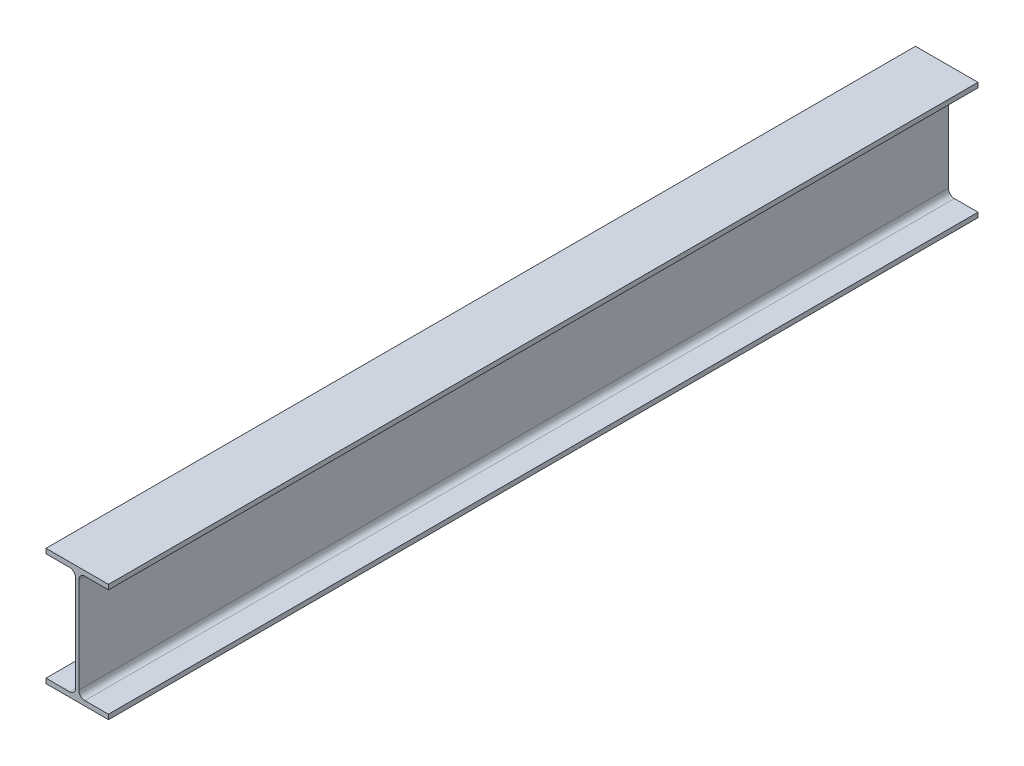
ISO-10303-21;
HEADER;
FILE_DESCRIPTION(('STEP AP214'),'2;1');
FILE_NAME('part.step','',(''),(''),'','','');
FILE_SCHEMA(('AUTOMOTIVE_DESIGN { 1 0 10303 214 1 1 1 1 }'));
ENDSEC;
DATA;
#1=APPLICATION_CONTEXT('core data for automotive mechanical design processes');
#2=APPLICATION_PROTOCOL_DEFINITION('international standard','automotive_design',2000,#1);
#3=PRODUCT_CONTEXT('',#1,'mechanical');
#4=PRODUCT('Part','Part','',(#3));
#5=PRODUCT_RELATED_PRODUCT_CATEGORY('part','',(#4));
#6=PRODUCT_DEFINITION_FORMATION('','',#4);
#7=PRODUCT_DEFINITION_CONTEXT('part definition',#1,'design');
#8=PRODUCT_DEFINITION('design','',#6,#7);
#9=PRODUCT_DEFINITION_SHAPE('','',#8);
#10=(LENGTH_UNIT() NAMED_UNIT(*) SI_UNIT(.MILLI.,.METRE.));
#11=(NAMED_UNIT(*) PLANE_ANGLE_UNIT() SI_UNIT($,.RADIAN.));
#12=(NAMED_UNIT(*) SI_UNIT($,.STERADIAN.) SOLID_ANGLE_UNIT());
#13=UNCERTAINTY_MEASURE_WITH_UNIT(LENGTH_MEASURE(1.E-05),#10,'distance_accuracy_value','');
#14=(GEOMETRIC_REPRESENTATION_CONTEXT(3) GLOBAL_UNCERTAINTY_ASSIGNED_CONTEXT((#13)) GLOBAL_UNIT_ASSIGNED_CONTEXT((#10,
#11,#12)) REPRESENTATION_CONTEXT('',''));
#15=CARTESIAN_POINT('',(0.,0.,0.));
#16=DIRECTION('',(0.,0.,1.));
#17=DIRECTION('',(1.,0.,0.));
#18=AXIS2_PLACEMENT_3D('',#15,#16,#17);
#19=CARTESIAN_POINT('',(-36.5,8.49645084468045,1016.));
#20=DIRECTION('',(1.,0.,0.));
#21=DIRECTION('',(0.,0.,-1.));
#22=AXIS2_PLACEMENT_3D('',#19,#20,#21);
#23=PLANE('',#22);
#24=DIRECTION('',(0.,-1.,0.));
#25=VECTOR('',#24,1.);
#26=CARTESIAN_POINT('',(-36.5,8.49645084468045,0.));
#27=LINE('',#26,#25);
#28=CARTESIAN_POINT('',(-36.5,14.0964508446805,0.));
#29=VERTEX_POINT('',#28);
#30=CARTESIAN_POINT('',(-36.5,8.49645084468045,0.));
#31=VERTEX_POINT('',#30);
#32=EDGE_CURVE('E190',#29,#31,#27,.T.);
#33=ORIENTED_EDGE('',*,*,#32,.T.);
#34=DIRECTION('',(0.,0.,-1.));
#35=VECTOR('',#34,1.);
#36=CARTESIAN_POINT('',(-36.5,8.49645084468045,1016.));
#37=LINE('',#36,#35);
#38=CARTESIAN_POINT('',(-36.5,8.49645084468045,1016.));
#39=VERTEX_POINT('',#38);
#40=EDGE_CURVE('E11',#39,#31,#37,.T.);
#41=ORIENTED_EDGE('',*,*,#40,.F.);
#42=DIRECTION('',(0.,-1.,0.));
#43=VECTOR('',#42,1.);
#44=CARTESIAN_POINT('',(-36.5,8.49645084468045,1016.));
#45=LINE('',#44,#43);
#46=CARTESIAN_POINT('',(-36.5,14.0964508446805,1016.));
#47=VERTEX_POINT('',#46);
#48=EDGE_CURVE('E236',#47,#39,#45,.T.);
#49=ORIENTED_EDGE('',*,*,#48,.F.);
#50=DIRECTION('',(0.,0.,-1.));
#51=VECTOR('',#50,1.);
#52=CARTESIAN_POINT('',(-36.5,14.0964508446805,1016.));
#53=LINE('',#52,#51);
#54=EDGE_CURVE('E186',#47,#29,#53,.T.);
#55=ORIENTED_EDGE('',*,*,#54,.T.);
#56=EDGE_LOOP('',(#33,#41,#49,#55));
#57=FACE_BOUND('',#56,.T.);
#58=ADVANCED_FACE('F41',(#57),#23,.F.);
#59=CARTESIAN_POINT('',(-8.9,8.49645084468046,1016.));
#60=DIRECTION('',(0.,1.,0.));
#61=DIRECTION('',(-1.,0.,0.));
#62=AXIS2_PLACEMENT_3D('',#59,#60,#61);
#63=PLANE('',#62);
#64=DIRECTION('',(1.,0.,0.));
#65=VECTOR('',#64,1.);
#66=CARTESIAN_POINT('',(-8.9,8.49645084468046,0.));
#67=LINE('',#66,#65);
#68=CARTESIAN_POINT('',(-8.9,8.49645084468046,0.));
#69=VERTEX_POINT('',#68);
#70=EDGE_CURVE('E194',#31,#69,#67,.T.);
#71=ORIENTED_EDGE('',*,*,#70,.T.);
#72=DIRECTION('',(0.,0.,-1.));
#73=VECTOR('',#72,1.);
#74=CARTESIAN_POINT('',(-8.9,8.49645084468046,1016.));
#75=LINE('',#74,#73);
#76=CARTESIAN_POINT('',(-8.9,8.49645084468046,1016.));
#77=VERTEX_POINT('',#76);
#78=EDGE_CURVE('E50',#77,#69,#75,.T.);
#79=ORIENTED_EDGE('',*,*,#78,.F.);
#80=DIRECTION('',(1.,0.,0.));
#81=VECTOR('',#80,1.);
#82=CARTESIAN_POINT('',(-8.9,8.49645084468046,1016.));
#83=LINE('',#82,#81);
#84=EDGE_CURVE('E125',#39,#77,#83,.T.);
#85=ORIENTED_EDGE('',*,*,#84,.F.);
#86=ORIENTED_EDGE('',*,*,#40,.T.);
#87=EDGE_LOOP('',(#71,#79,#85,#86));
#88=FACE_BOUND('',#87,.T.);
#89=ADVANCED_FACE('F358',(#88),#63,.F.);
#90=CARTESIAN_POINT('',(-8.9,1.49645084468046,1016.));
#91=DIRECTION('',(0.,0.,-1.));
#92=DIRECTION('',(-1.,0.,0.));
#93=AXIS2_PLACEMENT_3D('',#90,#91,#92);
#94=CYLINDRICAL_SURFACE('',#93,7.);
#95=CARTESIAN_POINT('',(-8.9,1.49645084468046,0.));
#96=DIRECTION('',(0.,0.,-1.));
#97=DIRECTION('',(-1.,0.,0.));
#98=AXIS2_PLACEMENT_3D('',#95,#96,#97);
#99=CIRCLE('',#98,7.);
#100=CARTESIAN_POINT('',(-1.9,1.49645084468046,0.));
#101=VERTEX_POINT('',#100);
#102=EDGE_CURVE('E197',#69,#101,#99,.T.);
#103=ORIENTED_EDGE('',*,*,#102,.T.);
#104=DIRECTION('',(0.,0.,-1.));
#105=VECTOR('',#104,1.);
#106=CARTESIAN_POINT('',(-1.9,1.49645084468046,1016.));
#107=LINE('',#106,#105);
#108=CARTESIAN_POINT('',(-1.9,1.49645084468046,1016.));
#109=VERTEX_POINT('',#108);
#110=EDGE_CURVE('E279',#109,#101,#107,.T.);
#111=ORIENTED_EDGE('',*,*,#110,.F.);
#112=CARTESIAN_POINT('',(-8.9,1.49645084468046,1016.));
#113=DIRECTION('',(0.,0.,-1.));
#114=DIRECTION('',(-1.,0.,0.));
#115=AXIS2_PLACEMENT_3D('',#112,#113,#114);
#116=CIRCLE('',#115,7.);
#117=EDGE_CURVE('E289',#77,#109,#116,.T.);
#118=ORIENTED_EDGE('',*,*,#117,.F.);
#119=ORIENTED_EDGE('',*,*,#78,.T.);
#120=EDGE_LOOP('',(#103,#111,#118,#119));
#121=FACE_BOUND('',#120,.T.);
#122=ADVANCED_FACE('F287',(#121),#94,.F.);
#123=CARTESIAN_POINT('',(-1.9,-110.30354915532,1016.));
#124=DIRECTION('',(1.,0.,0.));
#125=DIRECTION('',(0.,0.,-1.));
#126=AXIS2_PLACEMENT_3D('',#123,#124,#125);
#127=PLANE('',#126);
#128=DIRECTION('',(0.,-1.,0.));
#129=VECTOR('',#128,1.);
#130=CARTESIAN_POINT('',(-1.9,-110.30354915532,0.));
#131=LINE('',#130,#129);
#132=CARTESIAN_POINT('',(-1.9,-110.30354915532,0.));
#133=VERTEX_POINT('',#132);
#134=EDGE_CURVE('E200',#101,#133,#131,.T.);
#135=ORIENTED_EDGE('',*,*,#134,.T.);
#136=DIRECTION('',(0.,0.,-1.));
#137=VECTOR('',#136,1.);
#138=CARTESIAN_POINT('',(-1.9,-110.30354915532,1016.));
#139=LINE('',#138,#137);
#140=CARTESIAN_POINT('',(-1.9,-110.30354915532,1016.));
#141=VERTEX_POINT('',#140);
#142=EDGE_CURVE('E275',#141,#133,#139,.T.);
#143=ORIENTED_EDGE('',*,*,#142,.F.);
#144=DIRECTION('',(0.,-1.,0.));
#145=VECTOR('',#144,1.);
#146=CARTESIAN_POINT('',(-1.9,-110.30354915532,1016.));
#147=LINE('',#146,#145);
#148=EDGE_CURVE('E308',#109,#141,#147,.T.);
#149=ORIENTED_EDGE('',*,*,#148,.F.);
#150=ORIENTED_EDGE('',*,*,#110,.T.);
#151=EDGE_LOOP('',(#135,#143,#149,#150));
#152=FACE_BOUND('',#151,.T.);
#153=ADVANCED_FACE('F298',(#152),#127,.F.);
#154=CARTESIAN_POINT('',(-8.9,-110.30354915532,1016.));
#155=DIRECTION('',(0.,0.,-1.));
#156=DIRECTION('',(-1.,0.,0.));
#157=AXIS2_PLACEMENT_3D('',#154,#155,#156);
#158=CYLINDRICAL_SURFACE('',#157,7.);
#159=CARTESIAN_POINT('',(-8.9,-110.30354915532,0.));
#160=DIRECTION('',(0.,0.,-1.));
#161=DIRECTION('',(-1.,0.,0.));
#162=AXIS2_PLACEMENT_3D('',#159,#160,#161);
#163=CIRCLE('',#162,7.);
#164=CARTESIAN_POINT('',(-8.9,-117.30354915532,0.));
#165=VERTEX_POINT('',#164);
#166=EDGE_CURVE('E203',#133,#165,#163,.T.);
#167=ORIENTED_EDGE('',*,*,#166,.T.);
#168=DIRECTION('',(0.,0.,-1.));
#169=VECTOR('',#168,1.);
#170=CARTESIAN_POINT('',(-8.9,-117.30354915532,1016.));
#171=LINE('',#170,#169);
#172=CARTESIAN_POINT('',(-8.9,-117.30354915532,1016.));
#173=VERTEX_POINT('',#172);
#174=EDGE_CURVE('E271',#173,#165,#171,.T.);
#175=ORIENTED_EDGE('',*,*,#174,.F.);
#176=CARTESIAN_POINT('',(-8.9,-110.30354915532,1016.));
#177=DIRECTION('',(0.,0.,-1.));
#178=DIRECTION('',(-1.,0.,0.));
#179=AXIS2_PLACEMENT_3D('',#176,#177,#178);
#180=CIRCLE('',#179,7.);
#181=EDGE_CURVE('E304',#141,#173,#180,.T.);
#182=ORIENTED_EDGE('',*,*,#181,.F.);
#183=ORIENTED_EDGE('',*,*,#142,.T.);
#184=EDGE_LOOP('',(#167,#175,#182,#183));
#185=FACE_BOUND('',#184,.T.);
#186=ADVANCED_FACE('F302',(#185),#158,.F.);
#187=CARTESIAN_POINT('',(-36.5,-117.30354915532,1016.));
#188=DIRECTION('',(0.,-1.,0.));
#189=DIRECTION('',(0.,0.,-1.));
#190=AXIS2_PLACEMENT_3D('',#187,#188,#189);
#191=PLANE('',#190);
#192=DIRECTION('',(-1.,0.,0.));
#193=VECTOR('',#192,1.);
#194=CARTESIAN_POINT('',(-36.5,-117.30354915532,0.));
#195=LINE('',#194,#193);
#196=CARTESIAN_POINT('',(-36.5,-117.30354915532,0.));
#197=VERTEX_POINT('',#196);
#198=EDGE_CURVE('E206',#165,#197,#195,.T.);
#199=ORIENTED_EDGE('',*,*,#198,.T.);
#200=DIRECTION('',(0.,0.,-1.));
#201=VECTOR('',#200,1.);
#202=CARTESIAN_POINT('',(-36.5,-117.30354915532,1016.));
#203=LINE('',#202,#201);
#204=CARTESIAN_POINT('',(-36.5,-117.30354915532,1016.));
#205=VERTEX_POINT('',#204);
#206=EDGE_CURVE('E267',#205,#197,#203,.T.);
#207=ORIENTED_EDGE('',*,*,#206,.F.);
#208=DIRECTION('',(-1.,0.,0.));
#209=VECTOR('',#208,1.);
#210=CARTESIAN_POINT('',(-36.5,-117.30354915532,1016.));
#211=LINE('',#210,#209);
#212=EDGE_CURVE('E307',#173,#205,#211,.T.);
#213=ORIENTED_EDGE('',*,*,#212,.F.);
#214=ORIENTED_EDGE('',*,*,#174,.T.);
#215=EDGE_LOOP('',(#199,#207,#213,#214));
#216=FACE_BOUND('',#215,.T.);
#217=ADVANCED_FACE('F371',(#216),#191,.F.);
#218=CARTESIAN_POINT('',(-36.5,-122.90354915532,1016.));
#219=DIRECTION('',(1.,0.,0.));
#220=DIRECTION('',(0.,1.,0.));
#221=AXIS2_PLACEMENT_3D('',#218,#219,#220);
#222=PLANE('',#221);
#223=DIRECTION('',(0.,-1.,0.));
#224=VECTOR('',#223,1.);
#225=CARTESIAN_POINT('',(-36.5,-122.90354915532,0.));
#226=LINE('',#225,#224);
#227=CARTESIAN_POINT('',(-36.5,-122.90354915532,0.));
#228=VERTEX_POINT('',#227);
#229=EDGE_CURVE('E209',#197,#228,#226,.T.);
#230=ORIENTED_EDGE('',*,*,#229,.T.);
#231=DIRECTION('',(0.,0.,-1.));
#232=VECTOR('',#231,1.);
#233=CARTESIAN_POINT('',(-36.5,-122.90354915532,1016.));
#234=LINE('',#233,#232);
#235=CARTESIAN_POINT('',(-36.5,-122.90354915532,1016.));
#236=VERTEX_POINT('',#235);
#237=EDGE_CURVE('E263',#236,#228,#234,.T.);
#238=ORIENTED_EDGE('',*,*,#237,.F.);
#239=DIRECTION('',(0.,-1.,0.));
#240=VECTOR('',#239,1.);
#241=CARTESIAN_POINT('',(-36.5,-122.90354915532,1016.));
#242=LINE('',#241,#240);
#243=EDGE_CURVE('E312',#205,#236,#242,.T.);
#244=ORIENTED_EDGE('',*,*,#243,.F.);
#245=ORIENTED_EDGE('',*,*,#206,.T.);
#246=EDGE_LOOP('',(#230,#238,#244,#245));
#247=FACE_BOUND('',#246,.T.);
#248=ADVANCED_FACE('F374',(#247),#222,.F.);
#249=CARTESIAN_POINT('',(36.5,-122.90354915532,1016.));
#250=DIRECTION('',(0.,1.,0.));
#251=DIRECTION('',(-1.,0.,0.));
#252=AXIS2_PLACEMENT_3D('',#249,#250,#251);
#253=PLANE('',#252);
#254=DIRECTION('',(1.,0.,0.));
#255=VECTOR('',#254,1.);
#256=CARTESIAN_POINT('',(36.5,-122.90354915532,0.));
#257=LINE('',#256,#255);
#258=CARTESIAN_POINT('',(36.5,-122.90354915532,0.));
#259=VERTEX_POINT('',#258);
#260=EDGE_CURVE('E212',#228,#259,#257,.T.);
#261=ORIENTED_EDGE('',*,*,#260,.T.);
#262=DIRECTION('',(0.,0.,-1.));
#263=VECTOR('',#262,1.);
#264=CARTESIAN_POINT('',(36.5,-122.90354915532,1016.));
#265=LINE('',#264,#263);
#266=CARTESIAN_POINT('',(36.5,-122.90354915532,1016.));
#267=VERTEX_POINT('',#266);
#268=EDGE_CURVE('E259',#267,#259,#265,.T.);
#269=ORIENTED_EDGE('',*,*,#268,.F.);
#270=DIRECTION('',(1.,0.,0.));
#271=VECTOR('',#270,1.);
#272=CARTESIAN_POINT('',(36.5,-122.90354915532,1016.));
#273=LINE('',#272,#271);
#274=EDGE_CURVE('E319',#236,#267,#273,.T.);
#275=ORIENTED_EDGE('',*,*,#274,.F.);
#276=ORIENTED_EDGE('',*,*,#237,.T.);
#277=EDGE_LOOP('',(#261,#269,#275,#276));
#278=FACE_BOUND('',#277,.T.);
#279=ADVANCED_FACE('F378',(#278),#253,.F.);
#280=CARTESIAN_POINT('',(36.5,-117.30354915532,1016.));
#281=DIRECTION('',(-1.,0.,0.));
#282=DIRECTION('',(0.,-1.,0.));
#283=AXIS2_PLACEMENT_3D('',#280,#281,#282);
#284=PLANE('',#283);
#285=DIRECTION('',(0.,1.,0.));
#286=VECTOR('',#285,1.);
#287=CARTESIAN_POINT('',(36.5,-117.30354915532,0.));
#288=LINE('',#287,#286);
#289=CARTESIAN_POINT('',(36.5,-117.30354915532,0.));
#290=VERTEX_POINT('',#289);
#291=EDGE_CURVE('E215',#259,#290,#288,.T.);
#292=ORIENTED_EDGE('',*,*,#291,.T.);
#293=DIRECTION('',(0.,0.,-1.));
#294=VECTOR('',#293,1.);
#295=CARTESIAN_POINT('',(36.5,-117.30354915532,1016.));
#296=LINE('',#295,#294);
#297=CARTESIAN_POINT('',(36.5,-117.30354915532,1016.));
#298=VERTEX_POINT('',#297);
#299=EDGE_CURVE('E255',#298,#290,#296,.T.);
#300=ORIENTED_EDGE('',*,*,#299,.F.);
#301=DIRECTION('',(0.,1.,0.));
#302=VECTOR('',#301,1.);
#303=CARTESIAN_POINT('',(36.5,-117.30354915532,1016.));
#304=LINE('',#303,#302);
#305=EDGE_CURVE('E322',#267,#298,#304,.T.);
#306=ORIENTED_EDGE('',*,*,#305,.F.);
#307=ORIENTED_EDGE('',*,*,#268,.T.);
#308=EDGE_LOOP('',(#292,#300,#306,#307));
#309=FACE_BOUND('',#308,.T.);
#310=ADVANCED_FACE('F382',(#309),#284,.F.);
#311=CARTESIAN_POINT('',(8.90000000000001,-117.30354915532,1016.));
#312=DIRECTION('',(0.,-1.,0.));
#313=DIRECTION('',(0.,0.,-1.));
#314=AXIS2_PLACEMENT_3D('',#311,#312,#313);
#315=PLANE('',#314);
#316=DIRECTION('',(-1.,0.,0.));
#317=VECTOR('',#316,1.);
#318=CARTESIAN_POINT('',(8.90000000000001,-117.30354915532,0.));
#319=LINE('',#318,#317);
#320=CARTESIAN_POINT('',(8.90000000000002,-117.30354915532,0.));
#321=VERTEX_POINT('',#320);
#322=EDGE_CURVE('E218',#290,#321,#319,.T.);
#323=ORIENTED_EDGE('',*,*,#322,.T.);
#324=DIRECTION('',(0.,0.,-1.));
#325=VECTOR('',#324,1.);
#326=CARTESIAN_POINT('',(8.90000000000002,-117.30354915532,1016.));
#327=LINE('',#326,#325);
#328=CARTESIAN_POINT('',(8.90000000000002,-117.30354915532,1016.));
#329=VERTEX_POINT('',#328);
#330=EDGE_CURVE('E251',#329,#321,#327,.T.);
#331=ORIENTED_EDGE('',*,*,#330,.F.);
#332=DIRECTION('',(-1.,0.,0.));
#333=VECTOR('',#332,1.);
#334=CARTESIAN_POINT('',(8.90000000000001,-117.30354915532,1016.));
#335=LINE('',#334,#333);
#336=EDGE_CURVE('E325',#298,#329,#335,.T.);
#337=ORIENTED_EDGE('',*,*,#336,.F.);
#338=ORIENTED_EDGE('',*,*,#299,.T.);
#339=EDGE_LOOP('',(#323,#331,#337,#338));
#340=FACE_BOUND('',#339,.T.);
#341=ADVANCED_FACE('F386',(#340),#315,.F.);
#342=CARTESIAN_POINT('',(8.90000000000001,-110.30354915532,1016.));
#343=DIRECTION('',(0.,0.,-1.));
#344=DIRECTION('',(-1.,0.,0.));
#345=AXIS2_PLACEMENT_3D('',#342,#343,#344);
#346=CYLINDRICAL_SURFACE('',#345,7.);
#347=CARTESIAN_POINT('',(8.90000000000001,-110.30354915532,0.));
#348=DIRECTION('',(0.,0.,-1.));
#349=DIRECTION('',(-1.,0.,0.));
#350=AXIS2_PLACEMENT_3D('',#347,#348,#349);
#351=CIRCLE('',#350,7.);
#352=CARTESIAN_POINT('',(1.90000000000001,-110.30354915532,0.));
#353=VERTEX_POINT('',#352);
#354=EDGE_CURVE('E221',#321,#353,#351,.T.);
#355=ORIENTED_EDGE('',*,*,#354,.T.);
#356=DIRECTION('',(0.,0.,-1.));
#357=VECTOR('',#356,1.);
#358=CARTESIAN_POINT('',(1.90000000000001,-110.30354915532,1016.));
#359=LINE('',#358,#357);
#360=CARTESIAN_POINT('',(1.90000000000001,-110.30354915532,1016.));
#361=VERTEX_POINT('',#360);
#362=EDGE_CURVE('E247',#361,#353,#359,.T.);
#363=ORIENTED_EDGE('',*,*,#362,.F.);
#364=CARTESIAN_POINT('',(8.90000000000001,-110.30354915532,1016.));
#365=DIRECTION('',(0.,0.,-1.));
#366=DIRECTION('',(-1.,0.,0.));
#367=AXIS2_PLACEMENT_3D('',#364,#365,#366);
#368=CIRCLE('',#367,7.);
#369=EDGE_CURVE('E328',#329,#361,#368,.T.);
#370=ORIENTED_EDGE('',*,*,#369,.F.);
#371=ORIENTED_EDGE('',*,*,#330,.T.);
#372=EDGE_LOOP('',(#355,#363,#370,#371));
#373=FACE_BOUND('',#372,.T.);
#374=ADVANCED_FACE('F390',(#373),#346,.F.);
#375=CARTESIAN_POINT('',(1.9,1.49645084468046,1016.));
#376=DIRECTION('',(-1.,0.,0.));
#377=DIRECTION('',(0.,-1.,0.));
#378=AXIS2_PLACEMENT_3D('',#375,#376,#377);
#379=PLANE('',#378);
#380=DIRECTION('',(0.,1.,0.));
#381=VECTOR('',#380,1.);
#382=CARTESIAN_POINT('',(1.9,1.49645084468046,0.));
#383=LINE('',#382,#381);
#384=CARTESIAN_POINT('',(1.9,1.49645084468046,0.));
#385=VERTEX_POINT('',#384);
#386=EDGE_CURVE('E224',#353,#385,#383,.T.);
#387=ORIENTED_EDGE('',*,*,#386,.T.);
#388=DIRECTION('',(0.,0.,-1.));
#389=VECTOR('',#388,1.);
#390=CARTESIAN_POINT('',(1.9,1.49645084468046,1016.));
#391=LINE('',#390,#389);
#392=CARTESIAN_POINT('',(1.9,1.49645084468046,1016.));
#393=VERTEX_POINT('',#392);
#394=EDGE_CURVE('E243',#393,#385,#391,.T.);
#395=ORIENTED_EDGE('',*,*,#394,.F.);
#396=DIRECTION('',(0.,1.,0.));
#397=VECTOR('',#396,1.);
#398=CARTESIAN_POINT('',(1.9,1.49645084468046,1016.));
#399=LINE('',#398,#397);
#400=EDGE_CURVE('E331',#361,#393,#399,.T.);
#401=ORIENTED_EDGE('',*,*,#400,.F.);
#402=ORIENTED_EDGE('',*,*,#362,.T.);
#403=EDGE_LOOP('',(#387,#395,#401,#402));
#404=FACE_BOUND('',#403,.T.);
#405=ADVANCED_FACE('F339',(#404),#379,.F.);
#406=CARTESIAN_POINT('',(8.9,1.49645084468046,1016.));
#407=DIRECTION('',(0.,0.,-1.));
#408=DIRECTION('',(-1.,0.,0.));
#409=AXIS2_PLACEMENT_3D('',#406,#407,#408);
#410=CYLINDRICAL_SURFACE('',#409,7.);
#411=CARTESIAN_POINT('',(8.9,1.49645084468046,0.));
#412=DIRECTION('',(0.,0.,-1.));
#413=DIRECTION('',(-1.,0.,0.));
#414=AXIS2_PLACEMENT_3D('',#411,#412,#413);
#415=CIRCLE('',#414,7.);
#416=CARTESIAN_POINT('',(8.9,8.49645084468046,0.));
#417=VERTEX_POINT('',#416);
#418=EDGE_CURVE('E227',#385,#417,#415,.T.);
#419=ORIENTED_EDGE('',*,*,#418,.T.);
#420=DIRECTION('',(0.,0.,-1.));
#421=VECTOR('',#420,1.);
#422=CARTESIAN_POINT('',(8.9,8.49645084468046,1016.));
#423=LINE('',#422,#421);
#424=CARTESIAN_POINT('',(8.9,8.49645084468046,1016.));
#425=VERTEX_POINT('',#424);
#426=EDGE_CURVE('E179',#425,#417,#423,.T.);
#427=ORIENTED_EDGE('',*,*,#426,.F.);
#428=CARTESIAN_POINT('',(8.9,1.49645084468046,1016.));
#429=DIRECTION('',(0.,0.,-1.));
#430=DIRECTION('',(-1.,0.,0.));
#431=AXIS2_PLACEMENT_3D('',#428,#429,#430);
#432=CIRCLE('',#431,7.);
#433=EDGE_CURVE('E168',#393,#425,#432,.T.);
#434=ORIENTED_EDGE('',*,*,#433,.F.);
#435=ORIENTED_EDGE('',*,*,#394,.T.);
#436=EDGE_LOOP('',(#419,#427,#434,#435));
#437=FACE_BOUND('',#436,.T.);
#438=ADVANCED_FACE('F343',(#437),#410,.F.);
#439=CARTESIAN_POINT('',(36.5,8.49645084468046,1016.));
#440=DIRECTION('',(0.,1.,0.));
#441=DIRECTION('',(-1.,0.,0.));
#442=AXIS2_PLACEMENT_3D('',#439,#440,#441);
#443=PLANE('',#442);
#444=DIRECTION('',(1.,0.,0.));
#445=VECTOR('',#444,1.);
#446=CARTESIAN_POINT('',(36.5,8.49645084468046,0.));
#447=LINE('',#446,#445);
#448=CARTESIAN_POINT('',(36.5,8.49645084468046,0.));
#449=VERTEX_POINT('',#448);
#450=EDGE_CURVE('E177',#417,#449,#447,.T.);
#451=ORIENTED_EDGE('',*,*,#450,.T.);
#452=DIRECTION('',(0.,0.,-1.));
#453=VECTOR('',#452,1.);
#454=CARTESIAN_POINT('',(36.5,8.49645084468046,1016.));
#455=LINE('',#454,#453);
#456=CARTESIAN_POINT('',(36.5,8.49645084468046,1016.));
#457=VERTEX_POINT('',#456);
#458=EDGE_CURVE('E174',#457,#449,#455,.T.);
#459=ORIENTED_EDGE('',*,*,#458,.F.);
#460=DIRECTION('',(1.,0.,0.));
#461=VECTOR('',#460,1.);
#462=CARTESIAN_POINT('',(36.5,8.49645084468046,1016.));
#463=LINE('',#462,#461);
#464=EDGE_CURVE('E162',#425,#457,#463,.T.);
#465=ORIENTED_EDGE('',*,*,#464,.F.);
#466=ORIENTED_EDGE('',*,*,#426,.T.);
#467=EDGE_LOOP('',(#451,#459,#465,#466));
#468=FACE_BOUND('',#467,.T.);
#469=ADVANCED_FACE('F175',(#468),#443,.F.);
#470=CARTESIAN_POINT('',(36.5,14.0964508446805,1016.));
#471=DIRECTION('',(-1.,0.,0.));
#472=DIRECTION('',(0.,0.,1.));
#473=AXIS2_PLACEMENT_3D('',#470,#471,#472);
#474=PLANE('',#473);
#475=DIRECTION('',(0.,1.,0.));
#476=VECTOR('',#475,1.);
#477=CARTESIAN_POINT('',(36.5,14.0964508446805,0.));
#478=LINE('',#477,#476);
#479=CARTESIAN_POINT('',(36.5,14.0964508446805,0.));
#480=VERTEX_POINT('',#479);
#481=EDGE_CURVE('E111',#449,#480,#478,.T.);
#482=ORIENTED_EDGE('',*,*,#481,.T.);
#483=DIRECTION('',(0.,0.,-1.));
#484=VECTOR('',#483,1.);
#485=CARTESIAN_POINT('',(36.5,14.0964508446805,1016.));
#486=LINE('',#485,#484);
#487=CARTESIAN_POINT('',(36.5,14.0964508446805,1016.));
#488=VERTEX_POINT('',#487);
#489=EDGE_CURVE('E180',#488,#480,#486,.T.);
#490=ORIENTED_EDGE('',*,*,#489,.F.);
#491=DIRECTION('',(0.,1.,0.));
#492=VECTOR('',#491,1.);
#493=CARTESIAN_POINT('',(36.5,14.0964508446805,1016.));
#494=LINE('',#493,#492);
#495=EDGE_CURVE('E166',#457,#488,#494,.T.);
#496=ORIENTED_EDGE('',*,*,#495,.F.);
#497=ORIENTED_EDGE('',*,*,#458,.T.);
#498=EDGE_LOOP('',(#482,#490,#496,#497));
#499=FACE_BOUND('',#498,.T.);
#500=ADVANCED_FACE('F182',(#499),#474,.F.);
#501=CARTESIAN_POINT('',(-36.5,14.0964508446805,1016.));
#502=DIRECTION('',(0.,-1.,0.));
#503=DIRECTION('',(0.,0.,-1.));
#504=AXIS2_PLACEMENT_3D('',#501,#502,#503);
#505=PLANE('',#504);
#506=DIRECTION('',(-1.,0.,0.));
#507=VECTOR('',#506,1.);
#508=CARTESIAN_POINT('',(-36.5,14.0964508446805,0.));
#509=LINE('',#508,#507);
#510=EDGE_CURVE('E117',#480,#29,#509,.T.);
#511=ORIENTED_EDGE('',*,*,#510,.T.);
#512=ORIENTED_EDGE('',*,*,#54,.F.);
#513=DIRECTION('',(-1.,0.,0.));
#514=VECTOR('',#513,1.);
#515=CARTESIAN_POINT('',(-36.5,14.0964508446805,1016.));
#516=LINE('',#515,#514);
#517=EDGE_CURVE('E58',#488,#47,#516,.T.);
#518=ORIENTED_EDGE('',*,*,#517,.F.);
#519=ORIENTED_EDGE('',*,*,#489,.T.);
#520=EDGE_LOOP('',(#511,#512,#518,#519));
#521=FACE_BOUND('',#520,.T.);
#522=ADVANCED_FACE('F347',(#521),#505,.F.);
#523=CARTESIAN_POINT('',(8.9,1.49645084468046,1016.));
#524=DIRECTION('',(0.,0.,-1.));
#525=DIRECTION('',(-1.,0.,0.));
#526=AXIS2_PLACEMENT_3D('',#523,#524,#525);
#527=PLANE('',#526);
#528=ORIENTED_EDGE('',*,*,#48,.T.);
#529=ORIENTED_EDGE('',*,*,#84,.T.);
#530=ORIENTED_EDGE('',*,*,#117,.T.);
#531=ORIENTED_EDGE('',*,*,#148,.T.);
#532=ORIENTED_EDGE('',*,*,#181,.T.);
#533=ORIENTED_EDGE('',*,*,#212,.T.);
#534=ORIENTED_EDGE('',*,*,#243,.T.);
#535=ORIENTED_EDGE('',*,*,#274,.T.);
#536=ORIENTED_EDGE('',*,*,#305,.T.);
#537=ORIENTED_EDGE('',*,*,#336,.T.);
#538=ORIENTED_EDGE('',*,*,#369,.T.);
#539=ORIENTED_EDGE('',*,*,#400,.T.);
#540=ORIENTED_EDGE('',*,*,#433,.T.);
#541=ORIENTED_EDGE('',*,*,#464,.T.);
#542=ORIENTED_EDGE('',*,*,#495,.T.);
#543=ORIENTED_EDGE('',*,*,#517,.T.);
#544=EDGE_LOOP('',(#528,#529,#530,#531,#532,#533,#534,#535,#536,#537,#538,#539,#540,#541,#542,#543));
#545=FACE_BOUND('',#544,.T.);
#546=ADVANCED_FACE('F164',(#545),#527,.F.);
#547=CARTESIAN_POINT('',(8.9,1.49645084468046,0.));
#548=DIRECTION('',(0.,0.,-1.));
#549=DIRECTION('',(-1.,0.,0.));
#550=AXIS2_PLACEMENT_3D('',#547,#548,#549);
#551=PLANE('',#550);
#552=ORIENTED_EDGE('',*,*,#32,.F.);
#553=ORIENTED_EDGE('',*,*,#510,.F.);
#554=ORIENTED_EDGE('',*,*,#481,.F.);
#555=ORIENTED_EDGE('',*,*,#450,.F.);
#556=ORIENTED_EDGE('',*,*,#418,.F.);
#557=ORIENTED_EDGE('',*,*,#386,.F.);
#558=ORIENTED_EDGE('',*,*,#354,.F.);
#559=ORIENTED_EDGE('',*,*,#322,.F.);
#560=ORIENTED_EDGE('',*,*,#291,.F.);
#561=ORIENTED_EDGE('',*,*,#260,.F.);
#562=ORIENTED_EDGE('',*,*,#229,.F.);
#563=ORIENTED_EDGE('',*,*,#198,.F.);
#564=ORIENTED_EDGE('',*,*,#166,.F.);
#565=ORIENTED_EDGE('',*,*,#134,.F.);
#566=ORIENTED_EDGE('',*,*,#102,.F.);
#567=ORIENTED_EDGE('',*,*,#70,.F.);
#568=EDGE_LOOP('',(#552,#553,#554,#555,#556,#557,#558,#559,#560,#561,#562,#563,#564,#565,#566,#567));
#569=FACE_BOUND('',#568,.T.);
#570=ADVANCED_FACE('F293',(#569),#551,.T.);
#571=CLOSED_SHELL('',(#58,#89,#122,#153,#186,#217,#248,#279,#310,#341,#374,#405,#438,#469,#500,
#522,#546,#570));
#572=MANIFOLD_SOLID_BREP('B2',#571);
#573=ADVANCED_BREP_SHAPE_REPRESENTATION('',(#18,#572),#14);
#574=SHAPE_DEFINITION_REPRESENTATION(#9,#573);
ENDSEC;
END-ISO-10303-21;
